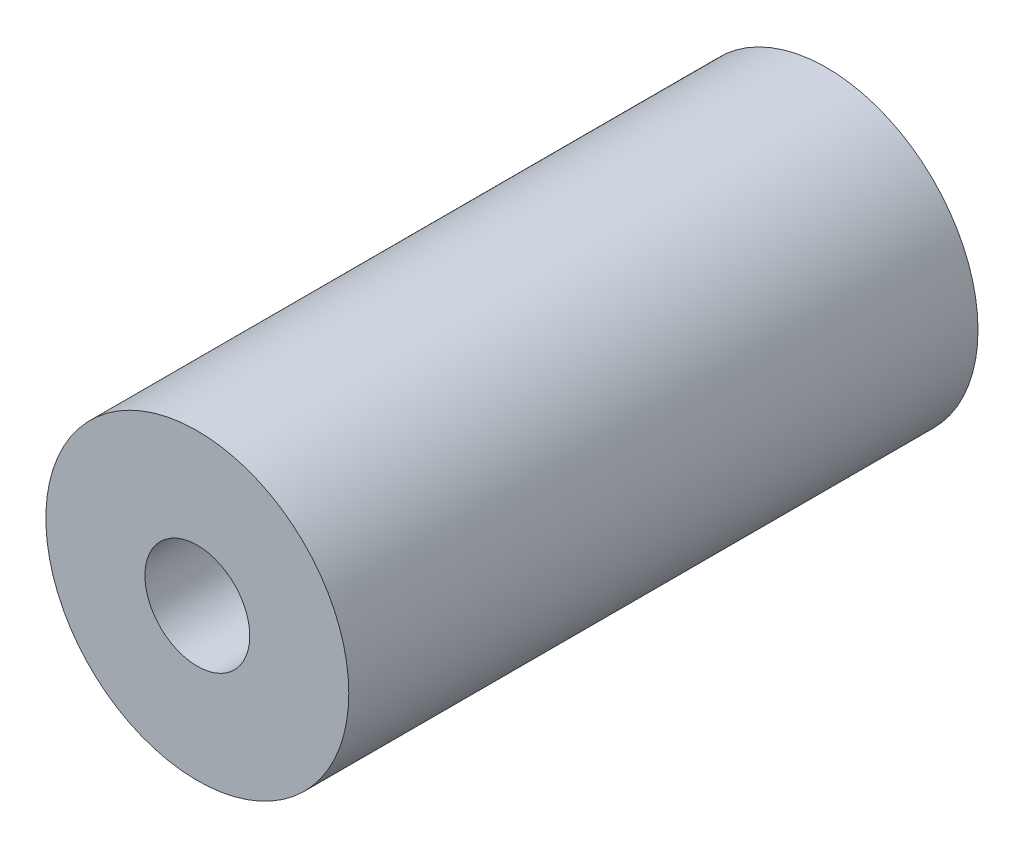
ISO-10303-21;
HEADER;
FILE_DESCRIPTION(('STEP AP214'),'2;1');
FILE_NAME('part.step','',(''),(''),'','','');
FILE_SCHEMA(('AUTOMOTIVE_DESIGN { 1 0 10303 214 1 1 1 1 }'));
ENDSEC;
DATA;
#1=APPLICATION_CONTEXT('core data for automotive mechanical design processes');
#2=APPLICATION_PROTOCOL_DEFINITION('international standard','automotive_design',2000,#1);
#3=PRODUCT_CONTEXT('',#1,'mechanical');
#4=PRODUCT('Part','Part','',(#3));
#5=PRODUCT_RELATED_PRODUCT_CATEGORY('part','',(#4));
#6=PRODUCT_DEFINITION_FORMATION('','',#4);
#7=PRODUCT_DEFINITION_CONTEXT('part definition',#1,'design');
#8=PRODUCT_DEFINITION('design','',#6,#7);
#9=PRODUCT_DEFINITION_SHAPE('','',#8);
#10=(LENGTH_UNIT() NAMED_UNIT(*) SI_UNIT(.MILLI.,.METRE.));
#11=(NAMED_UNIT(*) PLANE_ANGLE_UNIT() SI_UNIT($,.RADIAN.));
#12=(NAMED_UNIT(*) SI_UNIT($,.STERADIAN.) SOLID_ANGLE_UNIT());
#13=UNCERTAINTY_MEASURE_WITH_UNIT(LENGTH_MEASURE(1.E-05),#10,'distance_accuracy_value','');
#14=(GEOMETRIC_REPRESENTATION_CONTEXT(3) GLOBAL_UNCERTAINTY_ASSIGNED_CONTEXT((#13)) GLOBAL_UNIT_ASSIGNED_CONTEXT((#10,
#11,#12)) REPRESENTATION_CONTEXT('',''));
#15=CARTESIAN_POINT('',(0.,0.,0.));
#16=DIRECTION('',(0.,0.,1.));
#17=DIRECTION('',(1.,0.,0.));
#18=AXIS2_PLACEMENT_3D('',#15,#16,#17);
#19=CARTESIAN_POINT('',(0.,0.,54.));
#20=DIRECTION('',(0.,0.,1.));
#21=DIRECTION('',(1.,0.,0.));
#22=AXIS2_PLACEMENT_3D('',#19,#20,#21);
#23=PLANE('',#22);
#24=CARTESIAN_POINT('',(0.,0.,54.));
#25=DIRECTION('',(0.,0.,1.));
#26=DIRECTION('',(1.,0.,0.));
#27=AXIS2_PLACEMENT_3D('',#24,#25,#26);
#28=CIRCLE('',#27,13.);
#29=CARTESIAN_POINT('',(13.,0.,54.));
#30=VERTEX_POINT('',#29);
#31=EDGE_CURVE('E10',#30,#30,#28,.T.);
#32=ORIENTED_EDGE('',*,*,#31,.T.);
#33=EDGE_LOOP('',(#32));
#34=FACE_BOUND('',#33,.T.);
#35=CARTESIAN_POINT('',(0.,0.,54.));
#36=DIRECTION('',(0.,0.,1.));
#37=DIRECTION('',(1.,0.,0.));
#38=AXIS2_PLACEMENT_3D('',#35,#36,#37);
#39=CIRCLE('',#38,4.5);
#40=CARTESIAN_POINT('',(4.5,0.,54.));
#41=VERTEX_POINT('',#40);
#42=EDGE_CURVE('E45',#41,#41,#39,.T.);
#43=ORIENTED_EDGE('',*,*,#42,.F.);
#44=EDGE_LOOP('',(#43));
#45=FACE_BOUND('',#44,.T.);
#46=ADVANCED_FACE('F34',(#34,#45),#23,.T.);
#47=CARTESIAN_POINT('',(0.,0.,0.));
#48=DIRECTION('',(0.,0.,1.));
#49=DIRECTION('',(1.,0.,0.));
#50=AXIS2_PLACEMENT_3D('',#47,#48,#49);
#51=PLANE('',#50);
#52=CARTESIAN_POINT('',(0.,0.,0.));
#53=DIRECTION('',(0.,0.,1.));
#54=DIRECTION('',(1.,0.,0.));
#55=AXIS2_PLACEMENT_3D('',#52,#53,#54);
#56=CIRCLE('',#55,13.);
#57=CARTESIAN_POINT('',(13.,0.,0.));
#58=VERTEX_POINT('',#57);
#59=EDGE_CURVE('E38',#58,#58,#56,.T.);
#60=ORIENTED_EDGE('',*,*,#59,.F.);
#61=EDGE_LOOP('',(#60));
#62=FACE_BOUND('',#61,.T.);
#63=CARTESIAN_POINT('',(0.,0.,0.));
#64=DIRECTION('',(0.,0.,1.));
#65=DIRECTION('',(1.,0.,0.));
#66=AXIS2_PLACEMENT_3D('',#63,#64,#65);
#67=CIRCLE('',#66,4.5);
#68=CARTESIAN_POINT('',(4.5,0.,0.));
#69=VERTEX_POINT('',#68);
#70=EDGE_CURVE('E47',#69,#69,#67,.T.);
#71=ORIENTED_EDGE('',*,*,#70,.T.);
#72=EDGE_LOOP('',(#71));
#73=FACE_BOUND('',#72,.T.);
#74=ADVANCED_FACE('F57',(#62,#73),#51,.F.);
#75=CARTESIAN_POINT('',(0.,0.,54.));
#76=DIRECTION('',(0.,0.,-1.));
#77=DIRECTION('',(-1.,0.,0.));
#78=AXIS2_PLACEMENT_3D('',#75,#76,#77);
#79=CYLINDRICAL_SURFACE('',#78,13.);
#80=ORIENTED_EDGE('',*,*,#31,.F.);
#81=EDGE_LOOP('',(#80));
#82=FACE_BOUND('',#81,.T.);
#83=ORIENTED_EDGE('',*,*,#59,.T.);
#84=EDGE_LOOP('',(#83));
#85=FACE_BOUND('',#84,.T.);
#86=ADVANCED_FACE('F36',(#82,#85),#79,.T.);
#87=CARTESIAN_POINT('',(0.,0.,54.));
#88=DIRECTION('',(0.,0.,-1.));
#89=DIRECTION('',(-1.,0.,0.));
#90=AXIS2_PLACEMENT_3D('',#87,#88,#89);
#91=CYLINDRICAL_SURFACE('',#90,4.5);
#92=ORIENTED_EDGE('',*,*,#42,.T.);
#93=EDGE_LOOP('',(#92));
#94=FACE_BOUND('',#93,.T.);
#95=ORIENTED_EDGE('',*,*,#70,.F.);
#96=EDGE_LOOP('',(#95));
#97=FACE_BOUND('',#96,.T.);
#98=ADVANCED_FACE('F53',(#94,#97),#91,.F.);
#99=CLOSED_SHELL('',(#46,#74,#86,#98));
#100=MANIFOLD_SOLID_BREP('B2',#99);
#101=ADVANCED_BREP_SHAPE_REPRESENTATION('',(#18,#100),#14);
#102=SHAPE_DEFINITION_REPRESENTATION(#9,#101);
ENDSEC;
END-ISO-10303-21;
